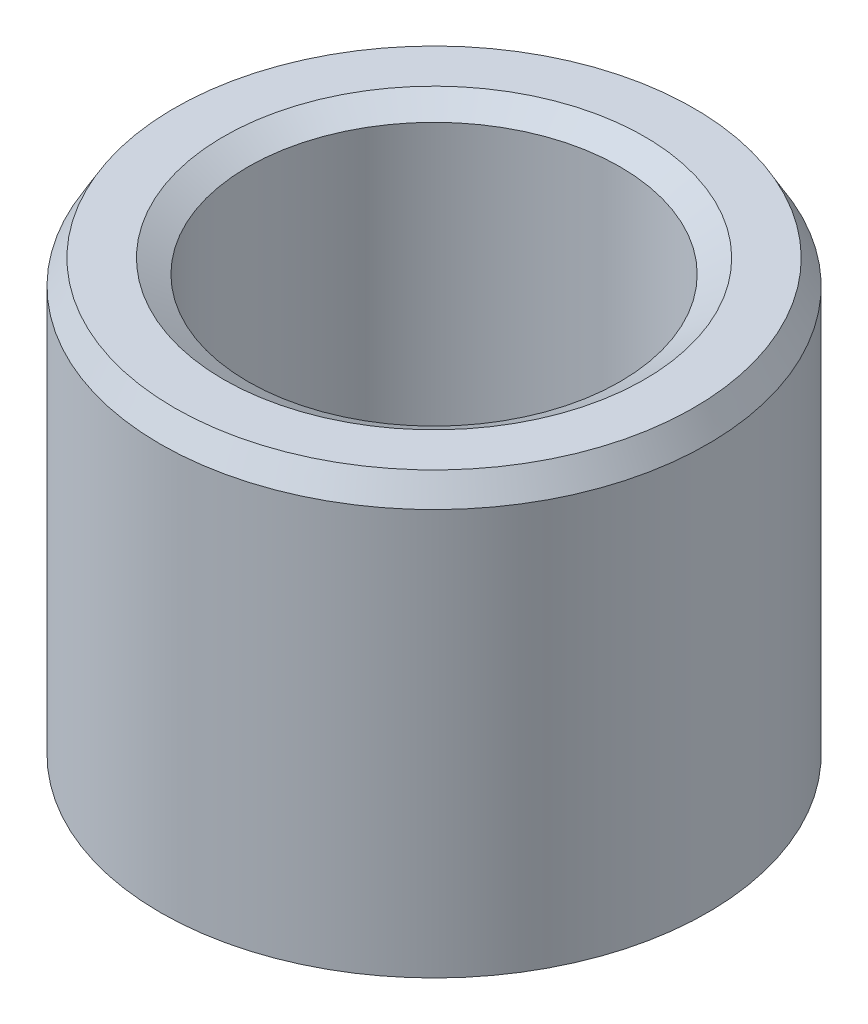
ISO-10303-21;
HEADER;
FILE_DESCRIPTION(('STEP AP214'),'2;1');
FILE_NAME('part.step','',(''),(''),'','','');
FILE_SCHEMA(('AUTOMOTIVE_DESIGN { 1 0 10303 214 1 1 1 1 }'));
ENDSEC;
DATA;
#1=APPLICATION_CONTEXT('core data for automotive mechanical design processes');
#2=APPLICATION_PROTOCOL_DEFINITION('international standard','automotive_design',2000,#1);
#3=PRODUCT_CONTEXT('',#1,'mechanical');
#4=PRODUCT('Part','Part','',(#3));
#5=PRODUCT_RELATED_PRODUCT_CATEGORY('part','',(#4));
#6=PRODUCT_DEFINITION_FORMATION('','',#4);
#7=PRODUCT_DEFINITION_CONTEXT('part definition',#1,'design');
#8=PRODUCT_DEFINITION('design','',#6,#7);
#9=PRODUCT_DEFINITION_SHAPE('','',#8);
#10=(LENGTH_UNIT() NAMED_UNIT(*) SI_UNIT(.MILLI.,.METRE.));
#11=(NAMED_UNIT(*) PLANE_ANGLE_UNIT() SI_UNIT($,.RADIAN.));
#12=(NAMED_UNIT(*) SI_UNIT($,.STERADIAN.) SOLID_ANGLE_UNIT());
#13=UNCERTAINTY_MEASURE_WITH_UNIT(LENGTH_MEASURE(1.E-05),#10,'distance_accuracy_value','');
#14=(GEOMETRIC_REPRESENTATION_CONTEXT(3) GLOBAL_UNCERTAINTY_ASSIGNED_CONTEXT((#13)) GLOBAL_UNIT_ASSIGNED_CONTEXT((#10,
#11,#12)) REPRESENTATION_CONTEXT('',''));
#15=CARTESIAN_POINT('',(0.,0.,0.));
#16=DIRECTION('',(0.,0.,1.));
#17=DIRECTION('',(1.,0.,0.));
#18=AXIS2_PLACEMENT_3D('',#15,#16,#17);
#19=CARTESIAN_POINT('',(0.,16.2249448904712,0.));
#20=DIRECTION('',(0.,-1.,0.));
#21=DIRECTION('',(0.,0.,-1.));
#22=AXIS2_PLACEMENT_3D('',#19,#20,#21);
#23=CYLINDRICAL_SURFACE('',#22,10.);
#24=CARTESIAN_POINT('',(0.,0.514239310660417,0.));
#25=DIRECTION('',(0.,1.,0.));
#26=DIRECTION('',(0.,0.,1.));
#27=AXIS2_PLACEMENT_3D('',#24,#25,#26);
#28=CIRCLE('',#27,10.);
#29=CARTESIAN_POINT('',(0.,0.514239310660417,10.));
#30=VERTEX_POINT('',#29);
#31=EDGE_CURVE('E10',#30,#30,#28,.T.);
#32=ORIENTED_EDGE('',*,*,#31,.T.);
#33=EDGE_LOOP('',(#32));
#34=FACE_BOUND('',#33,.T.);
#35=CARTESIAN_POINT('',(0.,15.3342562771581,0.));
#36=DIRECTION('',(0.,1.,0.));
#37=DIRECTION('',(0.,0.,1.));
#38=AXIS2_PLACEMENT_3D('',#35,#36,#37);
#39=CIRCLE('',#38,10.);
#40=CARTESIAN_POINT('',(0.,15.3342562771581,10.));
#41=VERTEX_POINT('',#40);
#42=EDGE_CURVE('E50',#41,#41,#39,.F.);
#43=ORIENTED_EDGE('',*,*,#42,.T.);
#44=EDGE_LOOP('',(#43));
#45=FACE_BOUND('',#44,.T.);
#46=ADVANCED_FACE('F39',(#34,#45),#23,.T.);
#47=CARTESIAN_POINT('',(0.,16.2249448904712,0.));
#48=DIRECTION('',(0.,1.,0.));
#49=DIRECTION('',(0.,0.,1.));
#50=AXIS2_PLACEMENT_3D('',#47,#48,#49);
#51=PLANE('',#50);
#52=CARTESIAN_POINT('',(0.,16.2249448904712,0.));
#53=DIRECTION('',(0.,1.,0.));
#54=DIRECTION('',(0.,0.,1.));
#55=AXIS2_PLACEMENT_3D('',#52,#53,#54);
#56=CIRCLE('',#55,7.68914001684207);
#57=CARTESIAN_POINT('',(0.,16.2249448904712,7.68914001684207));
#58=VERTEX_POINT('',#57);
#59=EDGE_CURVE('E58',#58,#58,#56,.F.);
#60=ORIENTED_EDGE('',*,*,#59,.T.);
#61=EDGE_LOOP('',(#60));
#62=FACE_BOUND('',#61,.T.);
#63=CARTESIAN_POINT('',(0.,16.2249448904712,0.));
#64=DIRECTION('',(0.,1.,0.));
#65=DIRECTION('',(0.,0.,1.));
#66=AXIS2_PLACEMENT_3D('',#63,#64,#65);
#67=CIRCLE('',#66,9.48576068933959);
#68=CARTESIAN_POINT('',(0.,16.2249448904712,9.48576068933959));
#69=VERTEX_POINT('',#68);
#70=EDGE_CURVE('E61',#69,#69,#67,.T.);
#71=ORIENTED_EDGE('',*,*,#70,.T.);
#72=EDGE_LOOP('',(#71));
#73=FACE_BOUND('',#72,.T.);
#74=ADVANCED_FACE('F88',(#62,#73),#51,.T.);
#75=CARTESIAN_POINT('',(0.,0.,0.));
#76=DIRECTION('',(0.,1.,0.));
#77=DIRECTION('',(0.,0.,1.));
#78=AXIS2_PLACEMENT_3D('',#75,#76,#77);
#79=PLANE('',#78);
#80=CARTESIAN_POINT('',(0.,0.,0.));
#81=DIRECTION('',(0.,1.,0.));
#82=DIRECTION('',(0.,0.,1.));
#83=AXIS2_PLACEMENT_3D('',#80,#81,#82);
#84=CIRCLE('',#83,7.31269071418944);
#85=CARTESIAN_POINT('',(0.,0.,7.31269071418944));
#86=VERTEX_POINT('',#85);
#87=EDGE_CURVE('E51',#86,#86,#84,.T.);
#88=ORIENTED_EDGE('',*,*,#87,.T.);
#89=EDGE_LOOP('',(#88));
#90=FACE_BOUND('',#89,.T.);
#91=CARTESIAN_POINT('',(0.,0.,0.));
#92=DIRECTION('',(0.,1.,0.));
#93=DIRECTION('',(0.,0.,1.));
#94=AXIS2_PLACEMENT_3D('',#91,#92,#93);
#95=CIRCLE('',#94,9.10931138668695);
#96=CARTESIAN_POINT('',(0.,0.,9.10931138668695));
#97=VERTEX_POINT('',#96);
#98=EDGE_CURVE('E54',#97,#97,#95,.F.);
#99=ORIENTED_EDGE('',*,*,#98,.T.);
#100=EDGE_LOOP('',(#99));
#101=FACE_BOUND('',#100,.T.);
#102=ADVANCED_FACE('F83',(#90,#101),#79,.F.);
#103=CARTESIAN_POINT('',(0.,16.2249448904712,0.));
#104=DIRECTION('',(0.,-1.,0.));
#105=DIRECTION('',(0.,0.,-1.));
#106=AXIS2_PLACEMENT_3D('',#103,#104,#105);
#107=CYLINDRICAL_SURFACE('',#106,6.79845140352901);
#108=CARTESIAN_POINT('',(0.,15.7107055798108,0.));
#109=DIRECTION('',(0.,1.,0.));
#110=DIRECTION('',(0.,0.,1.));
#111=AXIS2_PLACEMENT_3D('',#108,#109,#110);
#112=CIRCLE('',#111,6.79845140352901);
#113=CARTESIAN_POINT('',(0.,15.7107055798108,6.79845140352901));
#114=VERTEX_POINT('',#113);
#115=EDGE_CURVE('E67',#114,#114,#112,.T.);
#116=ORIENTED_EDGE('',*,*,#115,.T.);
#117=EDGE_LOOP('',(#116));
#118=FACE_BOUND('',#117,.T.);
#119=CARTESIAN_POINT('',(0.,0.890688613313057,0.));
#120=DIRECTION('',(0.,1.,0.));
#121=DIRECTION('',(0.,0.,1.));
#122=AXIS2_PLACEMENT_3D('',#119,#120,#121);
#123=CIRCLE('',#122,6.79845140352901);
#124=CARTESIAN_POINT('',(0.,0.890688613313057,6.79845140352901));
#125=VERTEX_POINT('',#124);
#126=EDGE_CURVE('E69',#125,#125,#123,.F.);
#127=ORIENTED_EDGE('',*,*,#126,.T.);
#128=EDGE_LOOP('',(#127));
#129=FACE_BOUND('',#128,.T.);
#130=ADVANCED_FACE('F71',(#118,#129),#107,.F.);
#131=CARTESIAN_POINT('',(0.,15.7107055798108,0.));
#132=DIRECTION('',(0.,1.,0.));
#133=DIRECTION('',(0.,0.,1.));
#134=AXIS2_PLACEMENT_3D('',#131,#132,#133);
#135=CONICAL_SURFACE('',#134,6.79845140352901,1.0471975511966);
#136=ORIENTED_EDGE('',*,*,#59,.F.);
#137=EDGE_LOOP('',(#136));
#138=FACE_BOUND('',#137,.T.);
#139=ORIENTED_EDGE('',*,*,#115,.F.);
#140=EDGE_LOOP('',(#139));
#141=FACE_BOUND('',#140,.T.);
#142=ADVANCED_FACE('F77',(#138,#141),#135,.F.);
#143=CARTESIAN_POINT('',(0.,0.,0.));
#144=DIRECTION('',(0.,-1.,0.));
#145=DIRECTION('',(0.,0.,-1.));
#146=AXIS2_PLACEMENT_3D('',#143,#144,#145);
#147=CONICAL_SURFACE('',#146,7.31269071418944,0.523598775598296);
#148=ORIENTED_EDGE('',*,*,#126,.F.);
#149=EDGE_LOOP('',(#148));
#150=FACE_BOUND('',#149,.T.);
#151=ORIENTED_EDGE('',*,*,#87,.F.);
#152=EDGE_LOOP('',(#151));
#153=FACE_BOUND('',#152,.T.);
#154=ADVANCED_FACE('F73',(#150,#153),#147,.F.);
#155=CARTESIAN_POINT('',(0.,0.514239310660417,0.));
#156=DIRECTION('',(0.,1.,0.));
#157=DIRECTION('',(0.,0.,1.));
#158=AXIS2_PLACEMENT_3D('',#155,#156,#157);
#159=CONICAL_SURFACE('',#158,10.,1.0471975511966);
#160=ORIENTED_EDGE('',*,*,#98,.F.);
#161=EDGE_LOOP('',(#160));
#162=FACE_BOUND('',#161,.T.);
#163=ORIENTED_EDGE('',*,*,#31,.F.);
#164=EDGE_LOOP('',(#163));
#165=FACE_BOUND('',#164,.T.);
#166=ADVANCED_FACE('F76',(#162,#165),#159,.T.);
#167=CARTESIAN_POINT('',(0.,16.2249448904712,0.));
#168=DIRECTION('',(0.,-1.,0.));
#169=DIRECTION('',(0.,0.,-1.));
#170=AXIS2_PLACEMENT_3D('',#167,#168,#169);
#171=CONICAL_SURFACE('',#170,9.48576068933959,0.523598775598296);
#172=ORIENTED_EDGE('',*,*,#42,.F.);
#173=EDGE_LOOP('',(#172));
#174=FACE_BOUND('',#173,.T.);
#175=ORIENTED_EDGE('',*,*,#70,.F.);
#176=EDGE_LOOP('',(#175));
#177=FACE_BOUND('',#176,.T.);
#178=ADVANCED_FACE('F45',(#174,#177),#171,.T.);
#179=CLOSED_SHELL('',(#46,#74,#102,#130,#142,#154,#166,#178));
#180=MANIFOLD_SOLID_BREP('B2',#179);
#181=ADVANCED_BREP_SHAPE_REPRESENTATION('',(#18,#180),#14);
#182=SHAPE_DEFINITION_REPRESENTATION(#9,#181);
ENDSEC;
END-ISO-10303-21;
